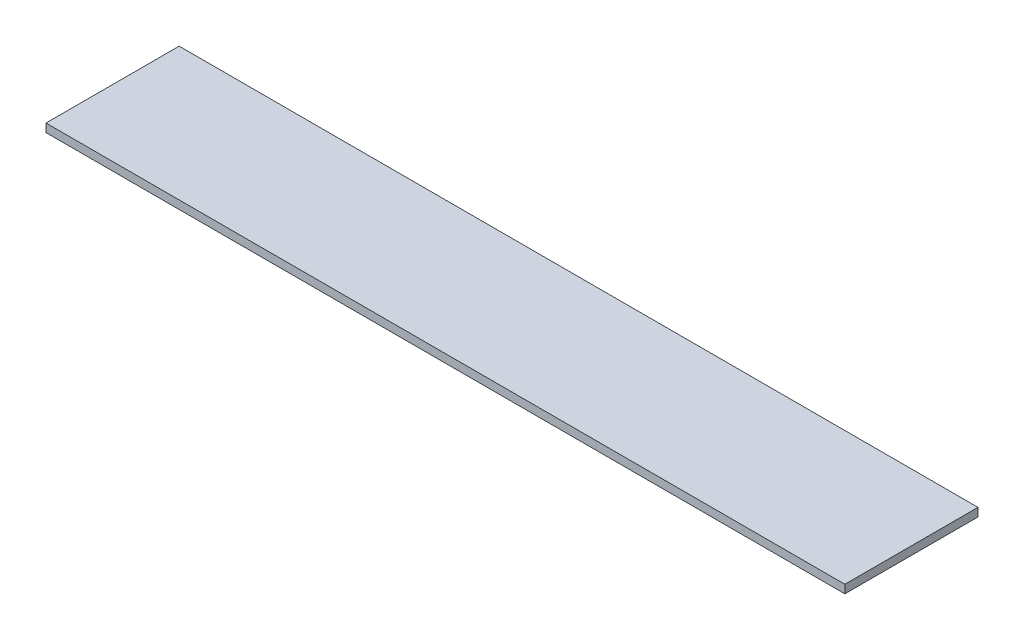
ISO-10303-21;
HEADER;
FILE_DESCRIPTION(('STEP AP214'),'2;1');
FILE_NAME('part.step','',(''),(''),'','','');
FILE_SCHEMA(('AUTOMOTIVE_DESIGN { 1 0 10303 214 1 1 1 1 }'));
ENDSEC;
DATA;
#1=APPLICATION_CONTEXT('core data for automotive mechanical design processes');
#2=APPLICATION_PROTOCOL_DEFINITION('international standard','automotive_design',2000,#1);
#3=PRODUCT_CONTEXT('',#1,'mechanical');
#4=PRODUCT('Part','Part','',(#3));
#5=PRODUCT_RELATED_PRODUCT_CATEGORY('part','',(#4));
#6=PRODUCT_DEFINITION_FORMATION('','',#4);
#7=PRODUCT_DEFINITION_CONTEXT('part definition',#1,'design');
#8=PRODUCT_DEFINITION('design','',#6,#7);
#9=PRODUCT_DEFINITION_SHAPE('','',#8);
#10=(LENGTH_UNIT() NAMED_UNIT(*) SI_UNIT(.MILLI.,.METRE.));
#11=(NAMED_UNIT(*) PLANE_ANGLE_UNIT() SI_UNIT($,.RADIAN.));
#12=(NAMED_UNIT(*) SI_UNIT($,.STERADIAN.) SOLID_ANGLE_UNIT());
#13=UNCERTAINTY_MEASURE_WITH_UNIT(LENGTH_MEASURE(1.E-05),#10,'distance_accuracy_value','');
#14=(GEOMETRIC_REPRESENTATION_CONTEXT(3) GLOBAL_UNCERTAINTY_ASSIGNED_CONTEXT((#13)) GLOBAL_UNIT_ASSIGNED_CONTEXT((#10,
#11,#12)) REPRESENTATION_CONTEXT('',''));
#15=CARTESIAN_POINT('',(0.,0.,0.));
#16=DIRECTION('',(0.,0.,1.));
#17=DIRECTION('',(1.,0.,0.));
#18=AXIS2_PLACEMENT_3D('',#15,#16,#17);
#19=CARTESIAN_POINT('',(0.,1.5875,0.));
#20=DIRECTION('',(1.,0.,0.));
#21=DIRECTION('',(0.,0.,-1.));
#22=AXIS2_PLACEMENT_3D('',#19,#20,#21);
#23=PLANE('',#22);
#24=DIRECTION('',(0.,0.,1.));
#25=VECTOR('',#24,1.);
#26=CARTESIAN_POINT('',(0.,0.,0.));
#27=LINE('',#26,#25);
#28=CARTESIAN_POINT('',(0.,0.,-25.4));
#29=VERTEX_POINT('',#28);
#30=CARTESIAN_POINT('',(0.,0.,0.));
#31=VERTEX_POINT('',#30);
#32=EDGE_CURVE('E91',#29,#31,#27,.T.);
#33=ORIENTED_EDGE('',*,*,#32,.T.);
#34=DIRECTION('',(0.,-1.,0.));
#35=VECTOR('',#34,1.);
#36=CARTESIAN_POINT('',(0.,1.5875,0.));
#37=LINE('',#36,#35);
#38=CARTESIAN_POINT('',(0.,1.5875,0.));
#39=VERTEX_POINT('',#38);
#40=EDGE_CURVE('E11',#39,#31,#37,.T.);
#41=ORIENTED_EDGE('',*,*,#40,.F.);
#42=DIRECTION('',(0.,0.,1.));
#43=VECTOR('',#42,1.);
#44=CARTESIAN_POINT('',(0.,1.5875,0.));
#45=LINE('',#44,#43);
#46=CARTESIAN_POINT('',(0.,1.5875,-25.4));
#47=VERTEX_POINT('',#46);
#48=EDGE_CURVE('E79',#47,#39,#45,.T.);
#49=ORIENTED_EDGE('',*,*,#48,.F.);
#50=DIRECTION('',(0.,-1.,0.));
#51=VECTOR('',#50,1.);
#52=CARTESIAN_POINT('',(0.,1.5875,-25.4));
#53=LINE('',#52,#51);
#54=EDGE_CURVE('E87',#47,#29,#53,.T.);
#55=ORIENTED_EDGE('',*,*,#54,.T.);
#56=EDGE_LOOP('',(#33,#41,#49,#55));
#57=FACE_BOUND('',#56,.T.);
#58=ADVANCED_FACE('F28',(#57),#23,.F.);
#59=CARTESIAN_POINT('',(0.,1.5875,0.));
#60=DIRECTION('',(0.,0.,-1.));
#61=DIRECTION('',(-1.,0.,0.));
#62=AXIS2_PLACEMENT_3D('',#59,#60,#61);
#63=PLANE('',#62);
#64=DIRECTION('',(1.,0.,0.));
#65=VECTOR('',#64,1.);
#66=CARTESIAN_POINT('',(0.,0.,0.));
#67=LINE('',#66,#65);
#68=CARTESIAN_POINT('',(152.4,0.,0.));
#69=VERTEX_POINT('',#68);
#70=EDGE_CURVE('E83',#31,#69,#67,.T.);
#71=ORIENTED_EDGE('',*,*,#70,.T.);
#72=DIRECTION('',(0.,-1.,0.));
#73=VECTOR('',#72,1.);
#74=CARTESIAN_POINT('',(152.4,1.5875,0.));
#75=LINE('',#74,#73);
#76=CARTESIAN_POINT('',(152.4,1.5875,0.));
#77=VERTEX_POINT('',#76);
#78=EDGE_CURVE('E36',#77,#69,#75,.T.);
#79=ORIENTED_EDGE('',*,*,#78,.F.);
#80=DIRECTION('',(1.,0.,0.));
#81=VECTOR('',#80,1.);
#82=CARTESIAN_POINT('',(0.,1.5875,0.));
#83=LINE('',#82,#81);
#84=EDGE_CURVE('E74',#39,#77,#83,.T.);
#85=ORIENTED_EDGE('',*,*,#84,.F.);
#86=ORIENTED_EDGE('',*,*,#40,.T.);
#87=EDGE_LOOP('',(#71,#79,#85,#86));
#88=FACE_BOUND('',#87,.T.);
#89=ADVANCED_FACE('F82',(#88),#63,.F.);
#90=CARTESIAN_POINT('',(152.4,1.5875,0.));
#91=DIRECTION('',(-1.,0.,0.));
#92=DIRECTION('',(0.,0.,1.));
#93=AXIS2_PLACEMENT_3D('',#90,#91,#92);
#94=PLANE('',#93);
#95=DIRECTION('',(0.,0.,-1.));
#96=VECTOR('',#95,1.);
#97=CARTESIAN_POINT('',(152.4,0.,0.));
#98=LINE('',#97,#96);
#99=CARTESIAN_POINT('',(152.4,0.,-25.4));
#100=VERTEX_POINT('',#99);
#101=EDGE_CURVE('E61',#69,#100,#98,.T.);
#102=ORIENTED_EDGE('',*,*,#101,.T.);
#103=DIRECTION('',(0.,-1.,0.));
#104=VECTOR('',#103,1.);
#105=CARTESIAN_POINT('',(152.4,1.5875,-25.4));
#106=LINE('',#105,#104);
#107=CARTESIAN_POINT('',(152.4,1.5875,-25.4));
#108=VERTEX_POINT('',#107);
#109=EDGE_CURVE('E84',#108,#100,#106,.T.);
#110=ORIENTED_EDGE('',*,*,#109,.F.);
#111=DIRECTION('',(0.,0.,-1.));
#112=VECTOR('',#111,1.);
#113=CARTESIAN_POINT('',(152.4,1.5875,0.));
#114=LINE('',#113,#112);
#115=EDGE_CURVE('E77',#77,#108,#114,.T.);
#116=ORIENTED_EDGE('',*,*,#115,.F.);
#117=ORIENTED_EDGE('',*,*,#78,.T.);
#118=EDGE_LOOP('',(#102,#110,#116,#117));
#119=FACE_BOUND('',#118,.T.);
#120=ADVANCED_FACE('F85',(#119),#94,.F.);
#121=CARTESIAN_POINT('',(0.,1.5875,-25.4));
#122=DIRECTION('',(0.,0.,1.));
#123=DIRECTION('',(1.,0.,0.));
#124=AXIS2_PLACEMENT_3D('',#121,#122,#123);
#125=PLANE('',#124);
#126=DIRECTION('',(-1.,0.,0.));
#127=VECTOR('',#126,1.);
#128=CARTESIAN_POINT('',(0.,0.,-25.4));
#129=LINE('',#128,#127);
#130=EDGE_CURVE('E67',#100,#29,#129,.T.);
#131=ORIENTED_EDGE('',*,*,#130,.T.);
#132=ORIENTED_EDGE('',*,*,#54,.F.);
#133=DIRECTION('',(-1.,0.,0.));
#134=VECTOR('',#133,1.);
#135=CARTESIAN_POINT('',(0.,1.5875,-25.4));
#136=LINE('',#135,#134);
#137=EDGE_CURVE('E44',#108,#47,#136,.T.);
#138=ORIENTED_EDGE('',*,*,#137,.F.);
#139=ORIENTED_EDGE('',*,*,#109,.T.);
#140=EDGE_LOOP('',(#131,#132,#138,#139));
#141=FACE_BOUND('',#140,.T.);
#142=ADVANCED_FACE('F98',(#141),#125,.F.);
#143=CARTESIAN_POINT('',(0.,1.5875,0.));
#144=DIRECTION('',(0.,-1.,0.));
#145=DIRECTION('',(0.,0.,-1.));
#146=AXIS2_PLACEMENT_3D('',#143,#144,#145);
#147=PLANE('',#146);
#148=ORIENTED_EDGE('',*,*,#48,.T.);
#149=ORIENTED_EDGE('',*,*,#84,.T.);
#150=ORIENTED_EDGE('',*,*,#115,.T.);
#151=ORIENTED_EDGE('',*,*,#137,.T.);
#152=EDGE_LOOP('',(#148,#149,#150,#151));
#153=FACE_BOUND('',#152,.T.);
#154=ADVANCED_FACE('F75',(#153),#147,.F.);
#155=CARTESIAN_POINT('',(0.,0.,0.));
#156=DIRECTION('',(0.,-1.,0.));
#157=DIRECTION('',(0.,0.,-1.));
#158=AXIS2_PLACEMENT_3D('',#155,#156,#157);
#159=PLANE('',#158);
#160=ORIENTED_EDGE('',*,*,#32,.F.);
#161=ORIENTED_EDGE('',*,*,#130,.F.);
#162=ORIENTED_EDGE('',*,*,#101,.F.);
#163=ORIENTED_EDGE('',*,*,#70,.F.);
#164=EDGE_LOOP('',(#160,#161,#162,#163));
#165=FACE_BOUND('',#164,.T.);
#166=ADVANCED_FACE('F101',(#165),#159,.T.);
#167=CLOSED_SHELL('',(#58,#89,#120,#142,#154,#166));
#168=MANIFOLD_SOLID_BREP('B2',#167);
#169=ADVANCED_BREP_SHAPE_REPRESENTATION('',(#18,#168),#14);
#170=SHAPE_DEFINITION_REPRESENTATION(#9,#169);
ENDSEC;
END-ISO-10303-21;
